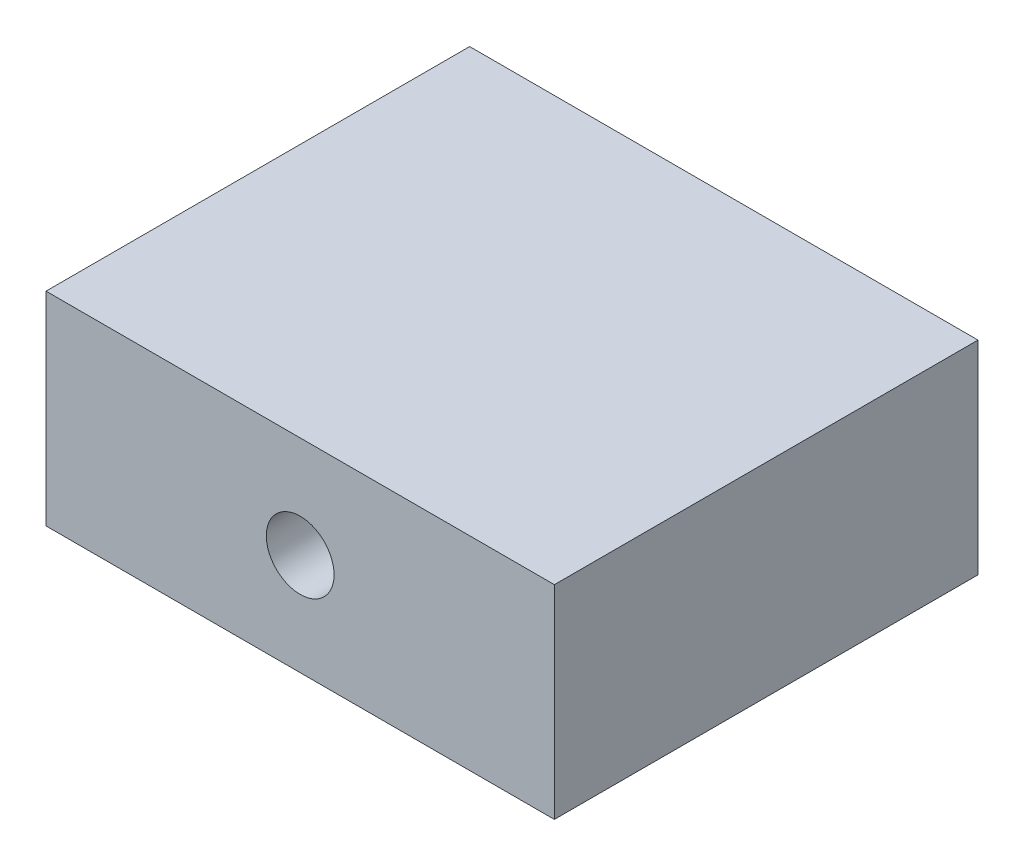
ISO-10303-21;
HEADER;
FILE_DESCRIPTION(('STEP AP214'),'2;1');
FILE_NAME('part.step','',(''),(''),'','','');
FILE_SCHEMA(('AUTOMOTIVE_DESIGN { 1 0 10303 214 1 1 1 1 }'));
ENDSEC;
DATA;
#1=APPLICATION_CONTEXT('core data for automotive mechanical design processes');
#2=APPLICATION_PROTOCOL_DEFINITION('international standard','automotive_design',2000,#1);
#3=PRODUCT_CONTEXT('',#1,'mechanical');
#4=PRODUCT('Part','Part','',(#3));
#5=PRODUCT_RELATED_PRODUCT_CATEGORY('part','',(#4));
#6=PRODUCT_DEFINITION_FORMATION('','',#4);
#7=PRODUCT_DEFINITION_CONTEXT('part definition',#1,'design');
#8=PRODUCT_DEFINITION('design','',#6,#7);
#9=PRODUCT_DEFINITION_SHAPE('','',#8);
#10=(LENGTH_UNIT() NAMED_UNIT(*) SI_UNIT(.MILLI.,.METRE.));
#11=(NAMED_UNIT(*) PLANE_ANGLE_UNIT() SI_UNIT($,.RADIAN.));
#12=(NAMED_UNIT(*) SI_UNIT($,.STERADIAN.) SOLID_ANGLE_UNIT());
#13=UNCERTAINTY_MEASURE_WITH_UNIT(LENGTH_MEASURE(1.E-05),#10,'distance_accuracy_value','');
#14=(GEOMETRIC_REPRESENTATION_CONTEXT(3) GLOBAL_UNCERTAINTY_ASSIGNED_CONTEXT((#13)) GLOBAL_UNIT_ASSIGNED_CONTEXT((#10,
#11,#12)) REPRESENTATION_CONTEXT('',''));
#15=CARTESIAN_POINT('',(0.,0.,0.));
#16=DIRECTION('',(0.,0.,1.));
#17=DIRECTION('',(1.,0.,0.));
#18=AXIS2_PLACEMENT_3D('',#15,#16,#17);
#19=CARTESIAN_POINT('',(0.,12.,0.));
#20=DIRECTION('',(1.,0.,0.));
#21=DIRECTION('',(0.,0.,-1.));
#22=AXIS2_PLACEMENT_3D('',#19,#20,#21);
#23=PLANE('',#22);
#24=DIRECTION('',(0.,0.,1.));
#25=VECTOR('',#24,1.);
#26=CARTESIAN_POINT('',(0.,0.,0.));
#27=LINE('',#26,#25);
#28=CARTESIAN_POINT('',(0.,0.,-25.));
#29=VERTEX_POINT('',#28);
#30=CARTESIAN_POINT('',(0.,0.,0.));
#31=VERTEX_POINT('',#30);
#32=EDGE_CURVE('E111',#29,#31,#27,.T.);
#33=ORIENTED_EDGE('',*,*,#32,.T.);
#34=DIRECTION('',(0.,-1.,0.));
#35=VECTOR('',#34,1.);
#36=CARTESIAN_POINT('',(0.,12.,0.));
#37=LINE('',#36,#35);
#38=CARTESIAN_POINT('',(0.,12.,0.));
#39=VERTEX_POINT('',#38);
#40=EDGE_CURVE('E13',#39,#31,#37,.T.);
#41=ORIENTED_EDGE('',*,*,#40,.F.);
#42=DIRECTION('',(0.,0.,1.));
#43=VECTOR('',#42,1.);
#44=CARTESIAN_POINT('',(0.,12.,0.));
#45=LINE('',#44,#43);
#46=CARTESIAN_POINT('',(0.,12.,-25.));
#47=VERTEX_POINT('',#46);
#48=EDGE_CURVE('E99',#47,#39,#45,.T.);
#49=ORIENTED_EDGE('',*,*,#48,.F.);
#50=DIRECTION('',(0.,-1.,0.));
#51=VECTOR('',#50,1.);
#52=CARTESIAN_POINT('',(0.,12.,-25.));
#53=LINE('',#52,#51);
#54=EDGE_CURVE('E107',#47,#29,#53,.T.);
#55=ORIENTED_EDGE('',*,*,#54,.T.);
#56=EDGE_LOOP('',(#33,#41,#49,#55));
#57=FACE_BOUND('',#56,.T.);
#58=ADVANCED_FACE('F48',(#57),#23,.F.);
#59=CARTESIAN_POINT('',(0.,12.,0.));
#60=DIRECTION('',(0.,0.,-1.));
#61=DIRECTION('',(-1.,0.,0.));
#62=AXIS2_PLACEMENT_3D('',#59,#60,#61);
#63=PLANE('',#62);
#64=CARTESIAN_POINT('',(15.,6.,0.));
#65=DIRECTION('',(0.,0.,1.));
#66=DIRECTION('',(1.,0.,0.));
#67=AXIS2_PLACEMENT_3D('',#64,#65,#66);
#68=CIRCLE('',#67,2.);
#69=CARTESIAN_POINT('',(17.,6.,0.));
#70=VERTEX_POINT('',#69);
#71=EDGE_CURVE('E125',#70,#70,#68,.T.);
#72=ORIENTED_EDGE('',*,*,#71,.F.);
#73=EDGE_LOOP('',(#72));
#74=FACE_BOUND('',#73,.T.);
#75=DIRECTION('',(1.,0.,0.));
#76=VECTOR('',#75,1.);
#77=CARTESIAN_POINT('',(0.,0.,0.));
#78=LINE('',#77,#76);
#79=CARTESIAN_POINT('',(30.,0.,0.));
#80=VERTEX_POINT('',#79);
#81=EDGE_CURVE('E103',#31,#80,#78,.T.);
#82=ORIENTED_EDGE('',*,*,#81,.T.);
#83=DIRECTION('',(0.,-1.,0.));
#84=VECTOR('',#83,1.);
#85=CARTESIAN_POINT('',(30.,12.,0.));
#86=LINE('',#85,#84);
#87=CARTESIAN_POINT('',(30.,12.,0.));
#88=VERTEX_POINT('',#87);
#89=EDGE_CURVE('E56',#88,#80,#86,.T.);
#90=ORIENTED_EDGE('',*,*,#89,.F.);
#91=DIRECTION('',(1.,0.,0.));
#92=VECTOR('',#91,1.);
#93=CARTESIAN_POINT('',(0.,12.,0.));
#94=LINE('',#93,#92);
#95=EDGE_CURVE('E94',#39,#88,#94,.T.);
#96=ORIENTED_EDGE('',*,*,#95,.F.);
#97=ORIENTED_EDGE('',*,*,#40,.T.);
#98=EDGE_LOOP('',(#82,#90,#96,#97));
#99=FACE_BOUND('',#98,.T.);
#100=ADVANCED_FACE('F102',(#74,#99),#63,.F.);
#101=CARTESIAN_POINT('',(30.,12.,0.));
#102=DIRECTION('',(-1.,0.,0.));
#103=DIRECTION('',(0.,0.,1.));
#104=AXIS2_PLACEMENT_3D('',#101,#102,#103);
#105=PLANE('',#104);
#106=DIRECTION('',(0.,0.,-1.));
#107=VECTOR('',#106,1.);
#108=CARTESIAN_POINT('',(30.,0.,0.));
#109=LINE('',#108,#107);
#110=CARTESIAN_POINT('',(30.,0.,-25.));
#111=VERTEX_POINT('',#110);
#112=EDGE_CURVE('E81',#80,#111,#109,.T.);
#113=ORIENTED_EDGE('',*,*,#112,.T.);
#114=DIRECTION('',(0.,-1.,0.));
#115=VECTOR('',#114,1.);
#116=CARTESIAN_POINT('',(30.,12.,-25.));
#117=LINE('',#116,#115);
#118=CARTESIAN_POINT('',(30.,12.,-25.));
#119=VERTEX_POINT('',#118);
#120=EDGE_CURVE('E104',#119,#111,#117,.T.);
#121=ORIENTED_EDGE('',*,*,#120,.F.);
#122=DIRECTION('',(0.,0.,-1.));
#123=VECTOR('',#122,1.);
#124=CARTESIAN_POINT('',(30.,12.,0.));
#125=LINE('',#124,#123);
#126=EDGE_CURVE('E97',#88,#119,#125,.T.);
#127=ORIENTED_EDGE('',*,*,#126,.F.);
#128=ORIENTED_EDGE('',*,*,#89,.T.);
#129=EDGE_LOOP('',(#113,#121,#127,#128));
#130=FACE_BOUND('',#129,.T.);
#131=ADVANCED_FACE('F105',(#130),#105,.F.);
#132=CARTESIAN_POINT('',(0.,12.,-25.));
#133=DIRECTION('',(0.,0.,1.));
#134=DIRECTION('',(1.,0.,0.));
#135=AXIS2_PLACEMENT_3D('',#132,#133,#134);
#136=PLANE('',#135);
#137=CARTESIAN_POINT('',(15.,6.,-25.));
#138=DIRECTION('',(0.,0.,1.));
#139=DIRECTION('',(1.,0.,0.));
#140=AXIS2_PLACEMENT_3D('',#137,#138,#139);
#141=CIRCLE('',#140,2.);
#142=CARTESIAN_POINT('',(17.,6.,-25.));
#143=VERTEX_POINT('',#142);
#144=EDGE_CURVE('E114',#143,#143,#141,.T.);
#145=ORIENTED_EDGE('',*,*,#144,.T.);
#146=EDGE_LOOP('',(#145));
#147=FACE_BOUND('',#146,.T.);
#148=DIRECTION('',(-1.,0.,0.));
#149=VECTOR('',#148,1.);
#150=CARTESIAN_POINT('',(0.,0.,-25.));
#151=LINE('',#150,#149);
#152=EDGE_CURVE('E87',#111,#29,#151,.T.);
#153=ORIENTED_EDGE('',*,*,#152,.T.);
#154=ORIENTED_EDGE('',*,*,#54,.F.);
#155=DIRECTION('',(-1.,0.,0.));
#156=VECTOR('',#155,1.);
#157=CARTESIAN_POINT('',(0.,12.,-25.));
#158=LINE('',#157,#156);
#159=EDGE_CURVE('E64',#119,#47,#158,.T.);
#160=ORIENTED_EDGE('',*,*,#159,.F.);
#161=ORIENTED_EDGE('',*,*,#120,.T.);
#162=EDGE_LOOP('',(#153,#154,#160,#161));
#163=FACE_BOUND('',#162,.T.);
#164=ADVANCED_FACE('F119',(#147,#163),#136,.F.);
#165=CARTESIAN_POINT('',(0.,12.,0.));
#166=DIRECTION('',(0.,-1.,0.));
#167=DIRECTION('',(0.,0.,-1.));
#168=AXIS2_PLACEMENT_3D('',#165,#166,#167);
#169=PLANE('',#168);
#170=ORIENTED_EDGE('',*,*,#48,.T.);
#171=ORIENTED_EDGE('',*,*,#95,.T.);
#172=ORIENTED_EDGE('',*,*,#126,.T.);
#173=ORIENTED_EDGE('',*,*,#159,.T.);
#174=EDGE_LOOP('',(#170,#171,#172,#173));
#175=FACE_BOUND('',#174,.T.);
#176=ADVANCED_FACE('F95',(#175),#169,.F.);
#177=CARTESIAN_POINT('',(0.,0.,0.));
#178=DIRECTION('',(0.,-1.,0.));
#179=DIRECTION('',(0.,0.,-1.));
#180=AXIS2_PLACEMENT_3D('',#177,#178,#179);
#181=PLANE('',#180);
#182=ORIENTED_EDGE('',*,*,#32,.F.);
#183=ORIENTED_EDGE('',*,*,#152,.F.);
#184=ORIENTED_EDGE('',*,*,#112,.F.);
#185=ORIENTED_EDGE('',*,*,#81,.F.);
#186=EDGE_LOOP('',(#182,#183,#184,#185));
#187=FACE_BOUND('',#186,.T.);
#188=ADVANCED_FACE('F122',(#187),#181,.T.);
#189=CARTESIAN_POINT('',(15.,6.,-25.));
#190=DIRECTION('',(0.,0.,1.));
#191=DIRECTION('',(1.,0.,0.));
#192=AXIS2_PLACEMENT_3D('',#189,#190,#191);
#193=CYLINDRICAL_SURFACE('',#192,2.);
#194=ORIENTED_EDGE('',*,*,#144,.F.);
#195=EDGE_LOOP('',(#194));
#196=FACE_BOUND('',#195,.T.);
#197=ORIENTED_EDGE('',*,*,#71,.T.);
#198=EDGE_LOOP('',(#197));
#199=FACE_BOUND('',#198,.T.);
#200=ADVANCED_FACE('F132',(#196,#199),#193,.F.);
#201=CLOSED_SHELL('',(#58,#100,#131,#164,#176,#188,#200));
#202=MANIFOLD_SOLID_BREP('B2',#201);
#203=ADVANCED_BREP_SHAPE_REPRESENTATION('',(#18,#202),#14);
#204=SHAPE_DEFINITION_REPRESENTATION(#9,#203);
ENDSEC;
END-ISO-10303-21;
